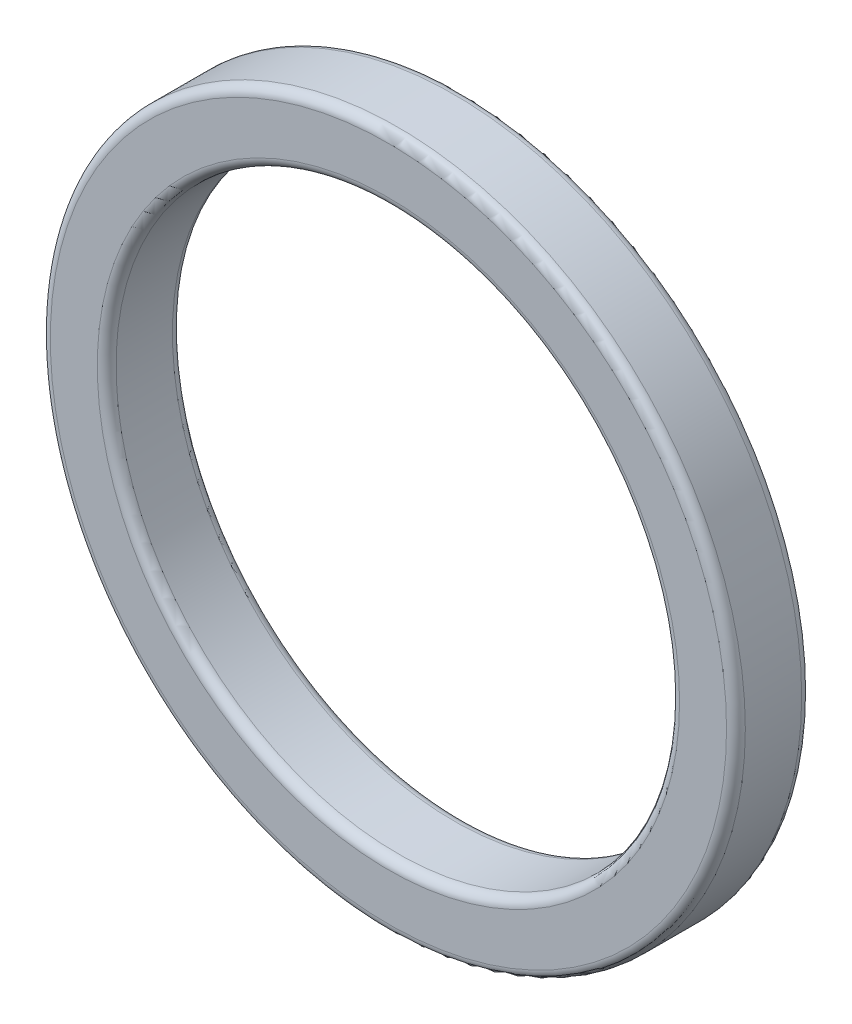
ISO-10303-21;
HEADER;
FILE_DESCRIPTION(('STEP AP214'),'2;1');
FILE_NAME('part.step','',(''),(''),'','','');
FILE_SCHEMA(('AUTOMOTIVE_DESIGN { 1 0 10303 214 1 1 1 1 }'));
ENDSEC;
DATA;
#1=APPLICATION_CONTEXT('core data for automotive mechanical design processes');
#2=APPLICATION_PROTOCOL_DEFINITION('international standard','automotive_design',2000,#1);
#3=PRODUCT_CONTEXT('',#1,'mechanical');
#4=PRODUCT('Part','Part','',(#3));
#5=PRODUCT_RELATED_PRODUCT_CATEGORY('part','',(#4));
#6=PRODUCT_DEFINITION_FORMATION('','',#4);
#7=PRODUCT_DEFINITION_CONTEXT('part definition',#1,'design');
#8=PRODUCT_DEFINITION('design','',#6,#7);
#9=PRODUCT_DEFINITION_SHAPE('','',#8);
#10=(LENGTH_UNIT() NAMED_UNIT(*) SI_UNIT(.MILLI.,.METRE.));
#11=(NAMED_UNIT(*) PLANE_ANGLE_UNIT() SI_UNIT($,.RADIAN.));
#12=(NAMED_UNIT(*) SI_UNIT($,.STERADIAN.) SOLID_ANGLE_UNIT());
#13=UNCERTAINTY_MEASURE_WITH_UNIT(LENGTH_MEASURE(1.E-05),#10,'distance_accuracy_value','');
#14=(GEOMETRIC_REPRESENTATION_CONTEXT(3) GLOBAL_UNCERTAINTY_ASSIGNED_CONTEXT((#13)) GLOBAL_UNIT_ASSIGNED_CONTEXT((#10,
#11,#12)) REPRESENTATION_CONTEXT('',''));
#15=CARTESIAN_POINT('',(0.,0.,0.));
#16=DIRECTION('',(0.,0.,1.));
#17=DIRECTION('',(1.,0.,0.));
#18=AXIS2_PLACEMENT_3D('',#15,#16,#17);
#19=CARTESIAN_POINT('',(0.,0.,4.));
#20=DIRECTION('',(0.,0.,1.));
#21=DIRECTION('',(1.,0.,0.));
#22=AXIS2_PLACEMENT_3D('',#19,#20,#21);
#23=PLANE('',#22);
#24=CARTESIAN_POINT('',(0.,0.,4.));
#25=DIRECTION('',(0.,0.,1.));
#26=DIRECTION('',(1.,0.,0.));
#27=AXIS2_PLACEMENT_3D('',#24,#25,#26);
#28=CIRCLE('',#27,15.5);
#29=CARTESIAN_POINT('',(15.5,0.,4.));
#30=VERTEX_POINT('',#29);
#31=EDGE_CURVE('E42',#30,#30,#28,.F.);
#32=ORIENTED_EDGE('',*,*,#31,.T.);
#33=EDGE_LOOP('',(#32));
#34=FACE_BOUND('',#33,.T.);
#35=CARTESIAN_POINT('',(0.,0.,4.));
#36=DIRECTION('',(0.,0.,1.));
#37=DIRECTION('',(1.,0.,0.));
#38=AXIS2_PLACEMENT_3D('',#35,#36,#37);
#39=CIRCLE('',#38,18.);
#40=CARTESIAN_POINT('',(18.,0.,4.));
#41=VERTEX_POINT('',#40);
#42=EDGE_CURVE('E46',#41,#41,#39,.T.);
#43=ORIENTED_EDGE('',*,*,#42,.T.);
#44=EDGE_LOOP('',(#43));
#45=FACE_BOUND('',#44,.T.);
#46=ADVANCED_FACE('F31',(#34,#45),#23,.T.);
#47=CARTESIAN_POINT('',(0.,0.,0.));
#48=DIRECTION('',(0.,0.,1.));
#49=DIRECTION('',(1.,0.,0.));
#50=AXIS2_PLACEMENT_3D('',#47,#48,#49);
#51=PLANE('',#50);
#52=CARTESIAN_POINT('',(0.,0.,0.));
#53=DIRECTION('',(0.,0.,1.));
#54=DIRECTION('',(1.,0.,0.));
#55=AXIS2_PLACEMENT_3D('',#52,#53,#54);
#56=CIRCLE('',#55,15.5);
#57=CARTESIAN_POINT('',(15.5,0.,0.));
#58=VERTEX_POINT('',#57);
#59=EDGE_CURVE('E57',#58,#58,#56,.T.);
#60=ORIENTED_EDGE('',*,*,#59,.T.);
#61=EDGE_LOOP('',(#60));
#62=FACE_BOUND('',#61,.T.);
#63=CARTESIAN_POINT('',(0.,0.,0.));
#64=DIRECTION('',(0.,0.,1.));
#65=DIRECTION('',(1.,0.,0.));
#66=AXIS2_PLACEMENT_3D('',#63,#64,#65);
#67=CIRCLE('',#66,18.);
#68=CARTESIAN_POINT('',(18.,0.,0.));
#69=VERTEX_POINT('',#68);
#70=EDGE_CURVE('E60',#69,#69,#67,.F.);
#71=ORIENTED_EDGE('',*,*,#70,.T.);
#72=EDGE_LOOP('',(#71));
#73=FACE_BOUND('',#72,.T.);
#74=ADVANCED_FACE('F64',(#62,#73),#51,.F.);
#75=CARTESIAN_POINT('',(0.,0.,4.));
#76=DIRECTION('',(0.,0.,-1.));
#77=DIRECTION('',(-1.,0.,0.));
#78=AXIS2_PLACEMENT_3D('',#75,#76,#77);
#79=CYLINDRICAL_SURFACE('',#78,18.5);
#80=CARTESIAN_POINT('',(0.,0.,0.5));
#81=DIRECTION('',(0.,0.,1.));
#82=DIRECTION('',(1.,0.,0.));
#83=AXIS2_PLACEMENT_3D('',#80,#81,#82);
#84=CIRCLE('',#83,18.5);
#85=CARTESIAN_POINT('',(18.5,0.,0.5));
#86=VERTEX_POINT('',#85);
#87=EDGE_CURVE('E10',#86,#86,#84,.T.);
#88=ORIENTED_EDGE('',*,*,#87,.T.);
#89=EDGE_LOOP('',(#88));
#90=FACE_BOUND('',#89,.T.);
#91=CARTESIAN_POINT('',(0.,0.,3.5));
#92=DIRECTION('',(0.,0.,1.));
#93=DIRECTION('',(1.,0.,0.));
#94=AXIS2_PLACEMENT_3D('',#91,#92,#93);
#95=CIRCLE('',#94,18.5);
#96=CARTESIAN_POINT('',(18.5,0.,3.5));
#97=VERTEX_POINT('',#96);
#98=EDGE_CURVE('E38',#97,#97,#95,.F.);
#99=ORIENTED_EDGE('',*,*,#98,.T.);
#100=EDGE_LOOP('',(#99));
#101=FACE_BOUND('',#100,.T.);
#102=ADVANCED_FACE('F84',(#90,#101),#79,.T.);
#103=CARTESIAN_POINT('',(0.,0.,4.));
#104=DIRECTION('',(0.,0.,-1.));
#105=DIRECTION('',(-1.,0.,0.));
#106=AXIS2_PLACEMENT_3D('',#103,#104,#105);
#107=CYLINDRICAL_SURFACE('',#106,15.);
#108=CARTESIAN_POINT('',(0.,0.,0.5));
#109=DIRECTION('',(0.,0.,1.));
#110=DIRECTION('',(1.,0.,0.));
#111=AXIS2_PLACEMENT_3D('',#108,#109,#110);
#112=CIRCLE('',#111,15.);
#113=CARTESIAN_POINT('',(15.,0.,0.5));
#114=VERTEX_POINT('',#113);
#115=EDGE_CURVE('E51',#114,#114,#112,.F.);
#116=ORIENTED_EDGE('',*,*,#115,.T.);
#117=EDGE_LOOP('',(#116));
#118=FACE_BOUND('',#117,.T.);
#119=CARTESIAN_POINT('',(0.,0.,3.5));
#120=DIRECTION('',(0.,0.,1.));
#121=DIRECTION('',(1.,0.,0.));
#122=AXIS2_PLACEMENT_3D('',#119,#120,#121);
#123=CIRCLE('',#122,15.);
#124=CARTESIAN_POINT('',(15.,0.,3.5));
#125=VERTEX_POINT('',#124);
#126=EDGE_CURVE('E54',#125,#125,#123,.T.);
#127=ORIENTED_EDGE('',*,*,#126,.T.);
#128=EDGE_LOOP('',(#127));
#129=FACE_BOUND('',#128,.T.);
#130=ADVANCED_FACE('F89',(#118,#129),#107,.F.);
#131=CARTESIAN_POINT('',(0.,0.,0.5));
#132=DIRECTION('',(0.,0.,1.));
#133=DIRECTION('',(1.,0.,0.));
#134=AXIS2_PLACEMENT_3D('',#131,#132,#133);
#135=TOROIDAL_SURFACE('',#134,15.5,0.5);
#136=ORIENTED_EDGE('',*,*,#115,.F.);
#137=EDGE_LOOP('',(#136));
#138=FACE_BOUND('',#137,.T.);
#139=ORIENTED_EDGE('',*,*,#59,.F.);
#140=EDGE_LOOP('',(#139));
#141=FACE_BOUND('',#140,.T.);
#142=ADVANCED_FACE('F75',(#138,#141),#135,.T.);
#143=CARTESIAN_POINT('',(0.,0.,3.5));
#144=DIRECTION('',(0.,0.,1.));
#145=DIRECTION('',(1.,0.,0.));
#146=AXIS2_PLACEMENT_3D('',#143,#144,#145);
#147=TOROIDAL_SURFACE('',#146,15.5,0.5);
#148=ORIENTED_EDGE('',*,*,#31,.F.);
#149=EDGE_LOOP('',(#148));
#150=FACE_BOUND('',#149,.T.);
#151=ORIENTED_EDGE('',*,*,#126,.F.);
#152=EDGE_LOOP('',(#151));
#153=FACE_BOUND('',#152,.T.);
#154=ADVANCED_FACE('F69',(#150,#153),#147,.T.);
#155=CARTESIAN_POINT('',(0.,0.,0.5));
#156=DIRECTION('',(0.,0.,1.));
#157=DIRECTION('',(1.,0.,0.));
#158=AXIS2_PLACEMENT_3D('',#155,#156,#157);
#159=TOROIDAL_SURFACE('',#158,18.,0.5);
#160=ORIENTED_EDGE('',*,*,#70,.F.);
#161=EDGE_LOOP('',(#160));
#162=FACE_BOUND('',#161,.T.);
#163=ORIENTED_EDGE('',*,*,#87,.F.);
#164=EDGE_LOOP('',(#163));
#165=FACE_BOUND('',#164,.T.);
#166=ADVANCED_FACE('F66',(#162,#165),#159,.T.);
#167=CARTESIAN_POINT('',(0.,0.,3.5));
#168=DIRECTION('',(0.,0.,1.));
#169=DIRECTION('',(1.,0.,0.));
#170=AXIS2_PLACEMENT_3D('',#167,#168,#169);
#171=TOROIDAL_SURFACE('',#170,18.,0.5);
#172=ORIENTED_EDGE('',*,*,#98,.F.);
#173=EDGE_LOOP('',(#172));
#174=FACE_BOUND('',#173,.T.);
#175=ORIENTED_EDGE('',*,*,#42,.F.);
#176=EDGE_LOOP('',(#175));
#177=FACE_BOUND('',#176,.T.);
#178=ADVANCED_FACE('F33',(#174,#177),#171,.T.);
#179=CLOSED_SHELL('',(#46,#74,#102,#130,#142,#154,#166,#178));
#180=MANIFOLD_SOLID_BREP('B2',#179);
#181=ADVANCED_BREP_SHAPE_REPRESENTATION('',(#18,#180),#14);
#182=SHAPE_DEFINITION_REPRESENTATION(#9,#181);
ENDSEC;
END-ISO-10303-21;
